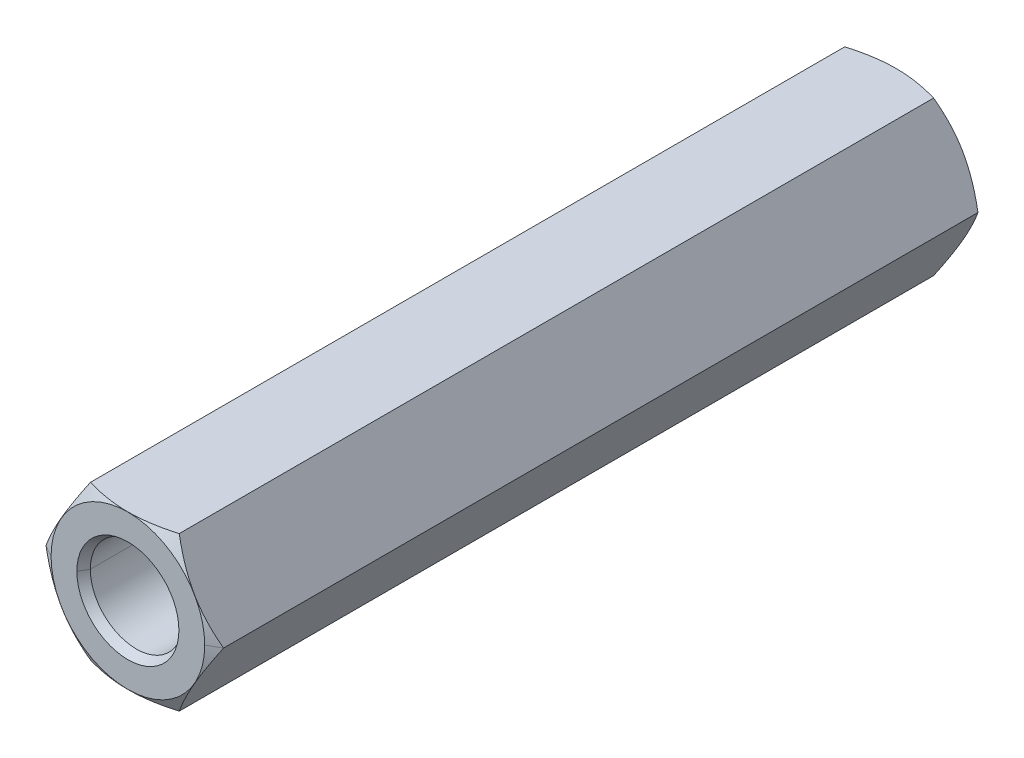
ISO-10303-21;
HEADER;
FILE_DESCRIPTION(('STEP AP214'),'2;1');
FILE_NAME('part.step','',(''),(''),'','','');
FILE_SCHEMA(('AUTOMOTIVE_DESIGN { 1 0 10303 214 1 1 1 1 }'));
ENDSEC;
DATA;
#1=APPLICATION_CONTEXT('core data for automotive mechanical design processes');
#2=APPLICATION_PROTOCOL_DEFINITION('international standard','automotive_design',2000,#1);
#3=PRODUCT_CONTEXT('',#1,'mechanical');
#4=PRODUCT('Part','Part','',(#3));
#5=PRODUCT_RELATED_PRODUCT_CATEGORY('part','',(#4));
#6=PRODUCT_DEFINITION_FORMATION('','',#4);
#7=PRODUCT_DEFINITION_CONTEXT('part definition',#1,'design');
#8=PRODUCT_DEFINITION('design','',#6,#7);
#9=PRODUCT_DEFINITION_SHAPE('','',#8);
#10=(LENGTH_UNIT() NAMED_UNIT(*) SI_UNIT(.MILLI.,.METRE.));
#11=(NAMED_UNIT(*) PLANE_ANGLE_UNIT() SI_UNIT($,.RADIAN.));
#12=(NAMED_UNIT(*) SI_UNIT($,.STERADIAN.) SOLID_ANGLE_UNIT());
#13=UNCERTAINTY_MEASURE_WITH_UNIT(LENGTH_MEASURE(1.E-05),#10,'distance_accuracy_value','');
#14=(GEOMETRIC_REPRESENTATION_CONTEXT(3) GLOBAL_UNCERTAINTY_ASSIGNED_CONTEXT((#13)) GLOBAL_UNIT_ASSIGNED_CONTEXT((#10,
#11,#12)) REPRESENTATION_CONTEXT('',''));
#15=CARTESIAN_POINT('',(0.,0.,0.));
#16=DIRECTION('',(0.,0.,1.));
#17=DIRECTION('',(1.,0.,0.));
#18=AXIS2_PLACEMENT_3D('',#15,#16,#17);
#19=CARTESIAN_POINT('',(220.318744279938,82.8420432923505,150.447608312383));
#20=DIRECTION('',(0.,0.,-1.));
#21=DIRECTION('',(1.,0.,0.));
#22=AXIS2_PLACEMENT_3D('',#19,#20,#21);
#23=CONICAL_SURFACE('',#22,1.7320508075705,1.047197551197);
#24=DIRECTION('',(0.86602540378464,0.,-0.499999999999652));
#25=VECTOR('',#24,1.);
#26=CARTESIAN_POINT('',(222.050795087508,82.8420432923505,150.447608312383));
#27=LINE('',#26,#25);
#28=CARTESIAN_POINT('',(220.318744279938,82.8420432923505,151.447608312383));
#29=VERTEX_POINT('',#28);
#30=CARTESIAN_POINT('',(221.818744279938,82.8420432923505,150.581582908599));
#31=VERTEX_POINT('',#30);
#32=EDGE_CURVE('E66',#29,#31,#27,.T.);
#33=ORIENTED_EDGE('',*,*,#32,.F.);
#34=DIRECTION('',(-0.86602540378464,0.,-0.499999999999652));
#35=VECTOR('',#34,1.);
#36=CARTESIAN_POINT('',(218.586693472367,82.8420432923505,150.447608312383));
#37=LINE('',#36,#35);
#38=CARTESIAN_POINT('',(218.818744279938,82.8420432923505,150.581582908599));
#39=VERTEX_POINT('',#38);
#40=EDGE_CURVE('E11',#29,#39,#37,.T.);
#41=ORIENTED_EDGE('',*,*,#40,.T.);
#42=CARTESIAN_POINT('',(220.318744279938,82.8420432923505,150.581582908599));
#43=DIRECTION('',(0.,0.,1.));
#44=DIRECTION('',(1.,0.,0.));
#45=AXIS2_PLACEMENT_3D('',#42,#43,#44);
#46=CIRCLE('',#45,1.5);
#47=EDGE_CURVE('E48',#31,#39,#46,.T.);
#48=ORIENTED_EDGE('',*,*,#47,.F.);
#49=EDGE_LOOP('',(#33,#41,#48));
#50=FACE_BOUND('',#49,.T.);
#51=ADVANCED_FACE('F44',(#50),#23,.F.);
#52=CARTESIAN_POINT('',(220.318744279938,82.8420432923505,150.581582908599));
#53=DIRECTION('',(0.,0.,-1.));
#54=DIRECTION('',(1.,0.,0.));
#55=AXIS2_PLACEMENT_3D('',#52,#53,#54);
#56=CYLINDRICAL_SURFACE('',#55,1.5);
#57=ORIENTED_EDGE('',*,*,#47,.T.);
#58=DIRECTION('',(0.,0.,-1.));
#59=VECTOR('',#58,1.);
#60=CARTESIAN_POINT('',(218.818744279938,82.8420432923505,150.581582908599));
#61=LINE('',#60,#59);
#62=CARTESIAN_POINT('',(218.818744279938,82.8420432923505,140.858711037809));
#63=VERTEX_POINT('',#62);
#64=EDGE_CURVE('E209',#39,#63,#61,.T.);
#65=ORIENTED_EDGE('',*,*,#64,.T.);
#66=CARTESIAN_POINT('',(220.318744279938,82.8420432923505,140.858711037809));
#67=DIRECTION('',(0.,0.,1.));
#68=DIRECTION('',(1.,0.,0.));
#69=AXIS2_PLACEMENT_3D('',#66,#67,#68);
#70=CIRCLE('',#69,1.5);
#71=CARTESIAN_POINT('',(221.818744279938,82.8420432923505,140.858711037809));
#72=VERTEX_POINT('',#71);
#73=EDGE_CURVE('E212',#72,#63,#70,.T.);
#74=ORIENTED_EDGE('',*,*,#73,.F.);
#75=DIRECTION('',(0.,0.,-1.));
#76=VECTOR('',#75,1.);
#77=CARTESIAN_POINT('',(221.818744279938,82.8420432923505,150.581582908599));
#78=LINE('',#77,#76);
#79=EDGE_CURVE('E306',#31,#72,#78,.T.);
#80=ORIENTED_EDGE('',*,*,#79,.F.);
#81=EDGE_LOOP('',(#57,#65,#74,#80));
#82=FACE_BOUND('',#81,.T.);
#83=ADVANCED_FACE('F420',(#82),#56,.F.);
#84=CARTESIAN_POINT('',(220.318744279938,82.8420432923505,140.858711037809));
#85=DIRECTION('',(0.,0.,-1.));
#86=DIRECTION('',(1.,0.,0.));
#87=AXIS2_PLACEMENT_3D('',#84,#85,#86);
#88=CONICAL_SURFACE('',#87,1.5,0.5235987756);
#89=ORIENTED_EDGE('',*,*,#73,.T.);
#90=DIRECTION('',(-0.500000000001473,0.,-0.866025403783588));
#91=VECTOR('',#90,1.);
#92=CARTESIAN_POINT('',(218.818744279938,82.8420432923505,140.858711037809));
#93=LINE('',#92,#91);
#94=CARTESIAN_POINT('',(218.658744279937,82.8420432923505,140.581582908599));
#95=VERTEX_POINT('',#94);
#96=EDGE_CURVE('E227',#63,#95,#93,.T.);
#97=ORIENTED_EDGE('',*,*,#96,.T.);
#98=CARTESIAN_POINT('',(220.318744279938,82.8420432923505,140.581582908599));
#99=DIRECTION('',(0.,0.,1.));
#100=DIRECTION('',(1.,0.,0.));
#101=AXIS2_PLACEMENT_3D('',#98,#99,#100);
#102=CIRCLE('',#101,1.66);
#103=CARTESIAN_POINT('',(221.978744279938,82.8420432923505,140.581582908599));
#104=VERTEX_POINT('',#103);
#105=EDGE_CURVE('E343',#104,#95,#102,.T.);
#106=ORIENTED_EDGE('',*,*,#105,.F.);
#107=DIRECTION('',(0.500000000001473,0.,-0.866025403783588));
#108=VECTOR('',#107,1.);
#109=CARTESIAN_POINT('',(221.818744279938,82.8420432923505,140.858711037809));
#110=LINE('',#109,#108);
#111=EDGE_CURVE('E321',#72,#104,#110,.T.);
#112=ORIENTED_EDGE('',*,*,#111,.F.);
#113=EDGE_LOOP('',(#89,#97,#106,#112));
#114=FACE_BOUND('',#113,.T.);
#115=ADVANCED_FACE('F434',(#114),#88,.F.);
#116=CARTESIAN_POINT('',(220.318744279938,82.8420432923505,140.581582908599));
#117=DIRECTION('',(0.,0.,1.));
#118=DIRECTION('',(1.,0.,0.));
#119=AXIS2_PLACEMENT_3D('',#116,#117,#118);
#120=CONICAL_SURFACE('',#119,2.5,1.047197551197);
#121=CARTESIAN_POINT('',(220.318744279938,82.8420432923505,140.581582908599));
#122=DIRECTION('',(0.,0.,1.));
#123=DIRECTION('',(1.,0.,0.));
#124=AXIS2_PLACEMENT_3D('',#121,#122,#123);
#125=CIRCLE('',#124,2.5);
#126=CARTESIAN_POINT('',(222.818744279938,82.8420432923505,140.581582908599));
#127=VERTEX_POINT('',#126);
#128=CARTESIAN_POINT('',(217.818744279938,82.8420432923505,140.581582908599));
#129=VERTEX_POINT('',#128);
#130=EDGE_CURVE('E224',#127,#129,#125,.T.);
#131=ORIENTED_EDGE('',*,*,#130,.T.);
#132=DIRECTION('',(-0.86602540378464,0.,0.499999999999652));
#133=VECTOR('',#132,1.);
#134=CARTESIAN_POINT('',(217.818744279938,82.8420432923505,140.581582908599));
#135=LINE('',#134,#133);
#136=CARTESIAN_POINT('',(217.428744279937,82.8420432923504,140.806749513583));
#137=VERTEX_POINT('',#136);
#138=EDGE_CURVE('E228',#129,#137,#135,.T.);
#139=ORIENTED_EDGE('',*,*,#138,.T.);
#140=CARTESIAN_POINT('',(218.873744279938,85.3448567092875,140.806749513583));
#141=CARTESIAN_POINT('',(218.151244279938,84.0934500008193,140.389613944093));
#142=CARTESIAN_POINT('',(217.428744279937,82.8420432923504,140.806749513583));
#143=(BOUNDED_CURVE() B_SPLINE_CURVE(2,(#140,#141,#142),.UNSPECIFIED.,.F.,
.F.) B_SPLINE_CURVE_WITH_KNOTS((3,3),(0.,1.),
.UNSPECIFIED.) CURVE() GEOMETRIC_REPRESENTATION_ITEM() RATIONAL_B_SPLINE_CURVE((1.,
1.15470053837935,1.)) REPRESENTATION_ITEM(''));
#144=CARTESIAN_POINT('',(218.873744279938,85.3448567092875,140.806749513583));
#145=VERTEX_POINT('',#144);
#146=EDGE_CURVE('E249',#145,#137,#143,.T.);
#147=ORIENTED_EDGE('',*,*,#146,.F.);
#148=CARTESIAN_POINT('',(221.763744279937,85.3448567092875,140.806749513583));
#149=CARTESIAN_POINT('',(220.318744279938,85.3448567092874,140.389613944093));
#150=CARTESIAN_POINT('',(218.873744279938,85.3448567092875,140.806749513583));
#151=(BOUNDED_CURVE() B_SPLINE_CURVE(2,(#148,#149,#150),.UNSPECIFIED.,.F.,
.F.) B_SPLINE_CURVE_WITH_KNOTS((3,3),(0.,1.),
.UNSPECIFIED.) CURVE() GEOMETRIC_REPRESENTATION_ITEM() RATIONAL_B_SPLINE_CURVE((1.,
1.15470053837926,1.)) REPRESENTATION_ITEM(''));
#152=CARTESIAN_POINT('',(221.763744279937,85.3448567092875,140.806749513583));
#153=VERTEX_POINT('',#152);
#154=EDGE_CURVE('E358',#153,#145,#151,.T.);
#155=ORIENTED_EDGE('',*,*,#154,.F.);
#156=CARTESIAN_POINT('',(223.208744279937,82.8420432923505,140.806749513583));
#157=CARTESIAN_POINT('',(222.486244279938,84.0934500008188,140.389613944093));
#158=CARTESIAN_POINT('',(221.763744279937,85.3448567092875,140.806749513583));
#159=(BOUNDED_CURVE() B_SPLINE_CURVE(2,(#156,#157,#158),.UNSPECIFIED.,.F.,
.F.) B_SPLINE_CURVE_WITH_KNOTS((3,3),(0.,1.),
.UNSPECIFIED.) CURVE() GEOMETRIC_REPRESENTATION_ITEM() RATIONAL_B_SPLINE_CURVE((1.,
1.15470053837946,1.)) REPRESENTATION_ITEM(''));
#160=CARTESIAN_POINT('',(223.208744279937,82.8420432923505,140.806749513583));
#161=VERTEX_POINT('',#160);
#162=EDGE_CURVE('E260',#161,#153,#159,.T.);
#163=ORIENTED_EDGE('',*,*,#162,.F.);
#164=DIRECTION('',(0.86602540378464,0.,0.499999999999652));
#165=VECTOR('',#164,1.);
#166=CARTESIAN_POINT('',(222.818744279938,82.8420432923505,140.581582908599));
#167=LINE('',#166,#165);
#168=EDGE_CURVE('E261',#127,#161,#167,.T.);
#169=ORIENTED_EDGE('',*,*,#168,.F.);
#170=EDGE_LOOP('',(#131,#139,#147,#155,#163,#169));
#171=FACE_BOUND('',#170,.T.);
#172=ADVANCED_FACE('F441',(#171),#120,.T.);
#173=CARTESIAN_POINT('',(220.318744279938,82.8420432923505,165.356416303615));
#174=DIRECTION('',(0.,0.,-1.));
#175=DIRECTION('',(1.,0.,0.));
#176=AXIS2_PLACEMENT_3D('',#173,#174,#175);
#177=CONICAL_SURFACE('',#176,2.89,1.047197551197);
#178=CARTESIAN_POINT('',(220.318744279938,82.8420432923505,165.581582908599));
#179=DIRECTION('',(0.,0.,1.));
#180=DIRECTION('',(1.,0.,0.));
#181=AXIS2_PLACEMENT_3D('',#178,#179,#180);
#182=CIRCLE('',#181,2.5);
#183=CARTESIAN_POINT('',(217.818744279938,82.8420432923505,165.581582908599));
#184=VERTEX_POINT('',#183);
#185=CARTESIAN_POINT('',(222.818744279938,82.8420432923505,165.581582908599));
#186=VERTEX_POINT('',#185);
#187=EDGE_CURVE('E218',#184,#186,#182,.T.);
#188=ORIENTED_EDGE('',*,*,#187,.F.);
#189=DIRECTION('',(-0.86602540378464,0.,-0.499999999999652));
#190=VECTOR('',#189,1.);
#191=CARTESIAN_POINT('',(217.428744279937,82.8420432923505,165.356416303615));
#192=LINE('',#191,#190);
#193=CARTESIAN_POINT('',(217.428744279937,82.8420432923505,165.356416303615));
#194=VERTEX_POINT('',#193);
#195=EDGE_CURVE('E178',#184,#194,#192,.T.);
#196=ORIENTED_EDGE('',*,*,#195,.T.);
#197=CARTESIAN_POINT('',(218.873744279938,80.3392298754135,165.356416303615));
#198=CARTESIAN_POINT('',(218.151244279937,81.5906365838815,165.773551873104));
#199=CARTESIAN_POINT('',(217.428744279937,82.8420432923505,165.356416303615));
#200=(BOUNDED_CURVE() B_SPLINE_CURVE(2,(#197,#198,#199),.UNSPECIFIED.,.F.,
.F.) B_SPLINE_CURVE_WITH_KNOTS((3,3),(0.,1.),
.UNSPECIFIED.) CURVE() GEOMETRIC_REPRESENTATION_ITEM() RATIONAL_B_SPLINE_CURVE((1.,
1.15470053837936,1.)) REPRESENTATION_ITEM(''));
#201=CARTESIAN_POINT('',(218.873744279938,80.3392298754135,165.356416303615));
#202=VERTEX_POINT('',#201);
#203=EDGE_CURVE('E171',#202,#194,#200,.T.);
#204=ORIENTED_EDGE('',*,*,#203,.F.);
#205=CARTESIAN_POINT('',(221.763744279937,80.3392298754135,165.356416303615));
#206=CARTESIAN_POINT('',(220.318744279938,80.3392298754134,165.773551873104));
#207=CARTESIAN_POINT('',(218.873744279938,80.3392298754135,165.356416303615));
#208=(BOUNDED_CURVE() B_SPLINE_CURVE(2,(#205,#206,#207),.UNSPECIFIED.,.F.,
.F.) B_SPLINE_CURVE_WITH_KNOTS((3,3),(0.,1.),
.UNSPECIFIED.) CURVE() GEOMETRIC_REPRESENTATION_ITEM() RATIONAL_B_SPLINE_CURVE((1.,
1.15470053837925,1.)) REPRESENTATION_ITEM(''));
#209=CARTESIAN_POINT('',(221.763744279937,80.3392298754135,165.356416303615));
#210=VERTEX_POINT('',#209);
#211=EDGE_CURVE('E175',#210,#202,#208,.T.);
#212=ORIENTED_EDGE('',*,*,#211,.F.);
#213=CARTESIAN_POINT('',(223.208744279937,82.8420432923505,165.356416303615));
#214=CARTESIAN_POINT('',(222.486244279938,81.5906365838821,165.773551873105));
#215=CARTESIAN_POINT('',(221.763744279937,80.3392298754135,165.356416303615));
#216=(BOUNDED_CURVE() B_SPLINE_CURVE(2,(#213,#214,#215),.UNSPECIFIED.,.F.,
.F.) B_SPLINE_CURVE_WITH_KNOTS((3,3),(0.,1.),
.UNSPECIFIED.) CURVE() GEOMETRIC_REPRESENTATION_ITEM() RATIONAL_B_SPLINE_CURVE((1.,
1.15470053837944,1.)) REPRESENTATION_ITEM(''));
#217=CARTESIAN_POINT('',(223.208744279937,82.8420432923505,165.356416303615));
#218=VERTEX_POINT('',#217);
#219=EDGE_CURVE('E278',#218,#210,#216,.T.);
#220=ORIENTED_EDGE('',*,*,#219,.F.);
#221=DIRECTION('',(0.86602540378464,0.,-0.499999999999652));
#222=VECTOR('',#221,1.);
#223=CARTESIAN_POINT('',(223.208744279937,82.8420432923505,165.356416303615));
#224=LINE('',#223,#222);
#225=EDGE_CURVE('E277',#186,#218,#224,.T.);
#226=ORIENTED_EDGE('',*,*,#225,.F.);
#227=EDGE_LOOP('',(#188,#196,#204,#212,#220,#226));
#228=FACE_BOUND('',#227,.T.);
#229=ADVANCED_FACE('F173',(#228),#177,.T.);
#230=CARTESIAN_POINT('',(220.318744279938,82.8420432923505,165.581582908599));
#231=DIRECTION('',(0.,0.,1.));
#232=DIRECTION('',(1.,0.,0.));
#233=AXIS2_PLACEMENT_3D('',#230,#231,#232);
#234=CONICAL_SURFACE('',#233,1.65999999999899,0.523598775598);
#235=CARTESIAN_POINT('',(220.318744279938,82.8420432923505,165.304454779388));
#236=DIRECTION('',(0.,0.,1.));
#237=DIRECTION('',(1.,0.,0.));
#238=AXIS2_PLACEMENT_3D('',#235,#236,#237);
#239=CIRCLE('',#238,1.5);
#240=CARTESIAN_POINT('',(218.818744279938,82.8420432923505,165.304454779388));
#241=VERTEX_POINT('',#240);
#242=CARTESIAN_POINT('',(221.818744279938,82.8420432923505,165.304454779388));
#243=VERTEX_POINT('',#242);
#244=EDGE_CURVE('E354',#241,#243,#239,.T.);
#245=ORIENTED_EDGE('',*,*,#244,.F.);
#246=DIRECTION('',(-0.499999999999741,0.,0.866025403784588));
#247=VECTOR('',#246,1.);
#248=CARTESIAN_POINT('',(218.658744279938,82.8420432923505,165.581582908599));
#249=LINE('',#248,#247);
#250=CARTESIAN_POINT('',(218.658744279938,82.8420432923505,165.581582908599));
#251=VERTEX_POINT('',#250);
#252=EDGE_CURVE('E245',#241,#251,#249,.T.);
#253=ORIENTED_EDGE('',*,*,#252,.T.);
#254=CARTESIAN_POINT('',(220.318744279938,82.8420432923505,165.581582908599));
#255=DIRECTION('',(0.,0.,1.));
#256=DIRECTION('',(1.,0.,0.));
#257=AXIS2_PLACEMENT_3D('',#254,#255,#256);
#258=CIRCLE('',#257,1.65999999999899);
#259=CARTESIAN_POINT('',(221.978744279937,82.8420432923505,165.581582908599));
#260=VERTEX_POINT('',#259);
#261=EDGE_CURVE('E266',#251,#260,#258,.T.);
#262=ORIENTED_EDGE('',*,*,#261,.T.);
#263=DIRECTION('',(0.499999999999741,0.,0.866025403784588));
#264=VECTOR('',#263,1.);
#265=CARTESIAN_POINT('',(221.978744279937,82.8420432923505,165.581582908599));
#266=LINE('',#265,#264);
#267=EDGE_CURVE('E325',#243,#260,#266,.T.);
#268=ORIENTED_EDGE('',*,*,#267,.F.);
#269=EDGE_LOOP('',(#245,#253,#262,#268));
#270=FACE_BOUND('',#269,.T.);
#271=ADVANCED_FACE('F443',(#270),#234,.F.);
#272=CARTESIAN_POINT('',(220.318744279938,82.8420432923505,165.304454779388));
#273=DIRECTION('',(0.,0.,-1.));
#274=DIRECTION('',(1.,0.,0.));
#275=AXIS2_PLACEMENT_3D('',#272,#273,#274);
#276=CYLINDRICAL_SURFACE('',#275,1.5);
#277=CARTESIAN_POINT('',(220.318744279938,82.8420432923505,165.304454779388));
#278=DIRECTION('',(0.,0.,1.));
#279=DIRECTION('',(1.,0.,0.));
#280=AXIS2_PLACEMENT_3D('',#277,#278,#279);
#281=CIRCLE('',#280,1.5);
#282=EDGE_CURVE('E270',#243,#241,#281,.T.);
#283=ORIENTED_EDGE('',*,*,#282,.T.);
#284=DIRECTION('',(0.,0.,-1.));
#285=VECTOR('',#284,1.);
#286=CARTESIAN_POINT('',(218.818744279938,82.8420432923505,165.304454779388));
#287=LINE('',#286,#285);
#288=CARTESIAN_POINT('',(218.818744279938,82.8420432923505,155.581582908599));
#289=VERTEX_POINT('',#288);
#290=EDGE_CURVE('E347',#241,#289,#287,.T.);
#291=ORIENTED_EDGE('',*,*,#290,.T.);
#292=CARTESIAN_POINT('',(220.318744279938,82.8420432923505,155.581582908599));
#293=DIRECTION('',(0.,0.,1.));
#294=DIRECTION('',(1.,0.,0.));
#295=AXIS2_PLACEMENT_3D('',#292,#293,#294);
#296=CIRCLE('',#295,1.5);
#297=CARTESIAN_POINT('',(221.818744279938,82.8420432923505,155.581582908599));
#298=VERTEX_POINT('',#297);
#299=EDGE_CURVE('E223',#298,#289,#296,.T.);
#300=ORIENTED_EDGE('',*,*,#299,.F.);
#301=DIRECTION('',(0.,0.,-1.));
#302=VECTOR('',#301,1.);
#303=CARTESIAN_POINT('',(221.818744279938,82.8420432923505,165.304454779388));
#304=LINE('',#303,#302);
#305=EDGE_CURVE('E328',#243,#298,#304,.T.);
#306=ORIENTED_EDGE('',*,*,#305,.F.);
#307=EDGE_LOOP('',(#283,#291,#300,#306));
#308=FACE_BOUND('',#307,.T.);
#309=ADVANCED_FACE('F446',(#308),#276,.F.);
#310=CARTESIAN_POINT('',(220.318744279938,82.8420432923505,155.581582908599));
#311=DIRECTION('',(0.,0.,1.));
#312=DIRECTION('',(1.,0.,0.));
#313=AXIS2_PLACEMENT_3D('',#310,#311,#312);
#314=CONICAL_SURFACE('',#313,1.5,1.047197551197);
#315=DIRECTION('',(0.86602540378464,0.,0.499999999999652));
#316=VECTOR('',#315,1.);
#317=CARTESIAN_POINT('',(221.818744279938,82.8420432923505,155.581582908599));
#318=LINE('',#317,#316);
#319=CARTESIAN_POINT('',(220.318744279938,82.8420432923505,154.715557504813));
#320=VERTEX_POINT('',#319);
#321=EDGE_CURVE('E219',#320,#298,#318,.T.);
#322=ORIENTED_EDGE('',*,*,#321,.F.);
#323=DIRECTION('',(-0.86602540378464,0.,0.499999999999652));
#324=VECTOR('',#323,1.);
#325=CARTESIAN_POINT('',(218.818744279938,82.8420432923505,155.581582908599));
#326=LINE('',#325,#324);
#327=EDGE_CURVE('E255',#320,#289,#326,.T.);
#328=ORIENTED_EDGE('',*,*,#327,.T.);
#329=CARTESIAN_POINT('',(220.318744279938,82.8420432923505,155.581582908599));
#330=DIRECTION('',(0.,0.,1.));
#331=DIRECTION('',(1.,0.,0.));
#332=AXIS2_PLACEMENT_3D('',#329,#330,#331);
#333=CIRCLE('',#332,1.5);
#334=EDGE_CURVE('E222',#289,#298,#333,.T.);
#335=ORIENTED_EDGE('',*,*,#334,.T.);
#336=EDGE_LOOP('',(#322,#328,#335));
#337=FACE_BOUND('',#336,.T.);
#338=ADVANCED_FACE('F458',(#337),#314,.F.);
#339=CARTESIAN_POINT('',(220.318744279938,82.8420432923505,155.581582908599));
#340=DIRECTION('',(0.,0.,1.));
#341=DIRECTION('',(1.,0.,0.));
#342=AXIS2_PLACEMENT_3D('',#339,#340,#341);
#343=CONICAL_SURFACE('',#342,1.5,1.047197551197);
#344=ORIENTED_EDGE('',*,*,#327,.F.);
#345=ORIENTED_EDGE('',*,*,#321,.T.);
#346=ORIENTED_EDGE('',*,*,#299,.T.);
#347=EDGE_LOOP('',(#344,#345,#346));
#348=FACE_BOUND('',#347,.T.);
#349=ADVANCED_FACE('F564',(#348),#343,.F.);
#350=CARTESIAN_POINT('',(220.318744279938,82.8420432923505,165.304454779388));
#351=DIRECTION('',(0.,0.,-1.));
#352=DIRECTION('',(1.,0.,0.));
#353=AXIS2_PLACEMENT_3D('',#350,#351,#352);
#354=CYLINDRICAL_SURFACE('',#353,1.5);
#355=ORIENTED_EDGE('',*,*,#290,.F.);
#356=ORIENTED_EDGE('',*,*,#244,.T.);
#357=ORIENTED_EDGE('',*,*,#305,.T.);
#358=ORIENTED_EDGE('',*,*,#334,.F.);
#359=EDGE_LOOP('',(#355,#356,#357,#358));
#360=FACE_BOUND('',#359,.T.);
#361=ADVANCED_FACE('F584',(#360),#354,.F.);
#362=CARTESIAN_POINT('',(220.318744279938,82.8420432923505,165.581582908599));
#363=DIRECTION('',(0.,0.,1.));
#364=DIRECTION('',(1.,0.,0.));
#365=AXIS2_PLACEMENT_3D('',#362,#363,#364);
#366=CONICAL_SURFACE('',#365,1.65999999999899,0.523598775598);
#367=ORIENTED_EDGE('',*,*,#252,.F.);
#368=ORIENTED_EDGE('',*,*,#282,.F.);
#369=ORIENTED_EDGE('',*,*,#267,.T.);
#370=CARTESIAN_POINT('',(220.318744279938,82.8420432923505,165.581582908599));
#371=DIRECTION('',(0.,0.,1.));
#372=DIRECTION('',(1.,0.,0.));
#373=AXIS2_PLACEMENT_3D('',#370,#371,#372);
#374=CIRCLE('',#373,1.65999999999899);
#375=EDGE_CURVE('E217',#260,#251,#374,.T.);
#376=ORIENTED_EDGE('',*,*,#375,.T.);
#377=EDGE_LOOP('',(#367,#368,#369,#376));
#378=FACE_BOUND('',#377,.T.);
#379=ADVANCED_FACE('F513',(#378),#366,.F.);
#380=CARTESIAN_POINT('',(220.318744279938,82.8420432923505,165.581582908599));
#381=DIRECTION('',(0.,0.,1.));
#382=DIRECTION('',(1.,0.,0.));
#383=AXIS2_PLACEMENT_3D('',#380,#381,#382);
#384=PLANE('',#383);
#385=CARTESIAN_POINT('',(220.318744279938,82.8420432923505,165.581582908599));
#386=DIRECTION('',(0.,0.,1.));
#387=DIRECTION('',(1.,0.,0.));
#388=AXIS2_PLACEMENT_3D('',#385,#386,#387);
#389=CIRCLE('',#388,2.5);
#390=EDGE_CURVE('E213',#186,#184,#389,.T.);
#391=ORIENTED_EDGE('',*,*,#390,.T.);
#392=ORIENTED_EDGE('',*,*,#187,.T.);
#393=EDGE_LOOP('',(#391,#392));
#394=FACE_BOUND('',#393,.T.);
#395=ORIENTED_EDGE('',*,*,#375,.F.);
#396=ORIENTED_EDGE('',*,*,#261,.F.);
#397=EDGE_LOOP('',(#395,#396));
#398=FACE_BOUND('',#397,.T.);
#399=ADVANCED_FACE('F468',(#394,#398),#384,.T.);
#400=CARTESIAN_POINT('',(220.318744279938,82.8420432923505,165.356416303615));
#401=DIRECTION('',(0.,0.,-1.));
#402=DIRECTION('',(1.,0.,0.));
#403=AXIS2_PLACEMENT_3D('',#400,#401,#402);
#404=CONICAL_SURFACE('',#403,2.89,1.047197551197);
#405=ORIENTED_EDGE('',*,*,#195,.F.);
#406=ORIENTED_EDGE('',*,*,#390,.F.);
#407=ORIENTED_EDGE('',*,*,#225,.T.);
#408=CARTESIAN_POINT('',(221.763744279937,85.3448567092875,165.356416303615));
#409=CARTESIAN_POINT('',(222.486244279938,84.0934500008193,165.773551873104));
#410=CARTESIAN_POINT('',(223.208744279937,82.8420432923505,165.356416303615));
#411=(BOUNDED_CURVE() B_SPLINE_CURVE(2,(#408,#409,#410),.UNSPECIFIED.,.F.,
.F.) B_SPLINE_CURVE_WITH_KNOTS((3,3),(0.,1.),
.UNSPECIFIED.) CURVE() GEOMETRIC_REPRESENTATION_ITEM() RATIONAL_B_SPLINE_CURVE((1.,
1.15470053837935,1.)) REPRESENTATION_ITEM(''));
#412=CARTESIAN_POINT('',(221.763744279937,85.3448567092875,165.356416303615));
#413=VERTEX_POINT('',#412);
#414=EDGE_CURVE('E293',#413,#218,#411,.T.);
#415=ORIENTED_EDGE('',*,*,#414,.F.);
#416=CARTESIAN_POINT('',(218.873744279938,85.3448567092875,165.356416303615));
#417=CARTESIAN_POINT('',(220.318744279937,85.3448567092874,165.773551873104));
#418=CARTESIAN_POINT('',(221.763744279937,85.3448567092875,165.356416303615));
#419=(BOUNDED_CURVE() B_SPLINE_CURVE(2,(#416,#417,#418),.UNSPECIFIED.,.F.,
.F.) B_SPLINE_CURVE_WITH_KNOTS((3,3),(0.,1.),
.UNSPECIFIED.) CURVE() GEOMETRIC_REPRESENTATION_ITEM() RATIONAL_B_SPLINE_CURVE((1.,
1.15470053837925,1.)) REPRESENTATION_ITEM(''));
#420=CARTESIAN_POINT('',(218.873744279938,85.3448567092875,165.356416303615));
#421=VERTEX_POINT('',#420);
#422=EDGE_CURVE('E365',#421,#413,#419,.T.);
#423=ORIENTED_EDGE('',*,*,#422,.F.);
#424=CARTESIAN_POINT('',(217.428744279937,82.8420432923505,165.356416303615));
#425=CARTESIAN_POINT('',(218.151244279937,84.0934500008188,165.773551873104));
#426=CARTESIAN_POINT('',(218.873744279938,85.3448567092875,165.356416303615));
#427=(BOUNDED_CURVE() B_SPLINE_CURVE(2,(#424,#425,#426),.UNSPECIFIED.,.F.,
.F.) B_SPLINE_CURVE_WITH_KNOTS((3,3),(0.,1.),
.UNSPECIFIED.) CURVE() GEOMETRIC_REPRESENTATION_ITEM() RATIONAL_B_SPLINE_CURVE((1.,
1.15470053837944,1.)) REPRESENTATION_ITEM(''));
#428=EDGE_CURVE('E265',#194,#421,#427,.T.);
#429=ORIENTED_EDGE('',*,*,#428,.F.);
#430=EDGE_LOOP('',(#405,#406,#407,#415,#423,#429));
#431=FACE_BOUND('',#430,.T.);
#432=ADVANCED_FACE('F462',(#431),#404,.T.);
#433=CARTESIAN_POINT('',(221.763744279937,80.3392298754135,140.581582908599));
#434=DIRECTION('',(-0.866025403784329,0.50000000000019,0.));
#435=DIRECTION('',(0.,0.,1.));
#436=AXIS2_PLACEMENT_3D('',#433,#434,#435);
#437=PLANE('',#436);
#438=DIRECTION('',(0.,0.,1.));
#439=VECTOR('',#438,1.);
#440=CARTESIAN_POINT('',(223.208744279937,82.8420432923505,140.806749513583));
#441=LINE('',#440,#439);
#442=EDGE_CURVE('E283',#161,#218,#441,.T.);
#443=ORIENTED_EDGE('',*,*,#442,.T.);
#444=ORIENTED_EDGE('',*,*,#219,.T.);
#445=DIRECTION('',(0.,0.,1.));
#446=VECTOR('',#445,1.);
#447=CARTESIAN_POINT('',(221.763744279937,80.3392298754135,140.581582908599));
#448=LINE('',#447,#446);
#449=CARTESIAN_POINT('',(221.763744279937,80.3392298754135,140.806749513583));
#450=VERTEX_POINT('',#449);
#451=EDGE_CURVE('E191',#450,#210,#448,.T.);
#452=ORIENTED_EDGE('',*,*,#451,.F.);
#453=CARTESIAN_POINT('',(221.763744279937,80.3392298754135,140.806749513583));
#454=CARTESIAN_POINT('',(222.486244279938,81.5906365838816,140.389613944093));
#455=CARTESIAN_POINT('',(223.208744279937,82.8420432923505,140.806749513583));
#456=(BOUNDED_CURVE() B_SPLINE_CURVE(2,(#453,#454,#455),.UNSPECIFIED.,.F.,
.F.) B_SPLINE_CURVE_WITH_KNOTS((3,3),(0.,1.),
.UNSPECIFIED.) CURVE() GEOMETRIC_REPRESENTATION_ITEM() RATIONAL_B_SPLINE_CURVE((1.,
1.15470053837935,1.)) REPRESENTATION_ITEM(''));
#457=EDGE_CURVE('E284',#450,#161,#456,.T.);
#458=ORIENTED_EDGE('',*,*,#457,.T.);
#459=EDGE_LOOP('',(#443,#444,#452,#458));
#460=FACE_BOUND('',#459,.T.);
#461=ADVANCED_FACE('F460',(#460),#437,.F.);
#462=CARTESIAN_POINT('',(218.873744279938,80.3392298754135,140.581582908599));
#463=DIRECTION('',(0.,1.,0.));
#464=DIRECTION('',(1.,0.,0.));
#465=AXIS2_PLACEMENT_3D('',#462,#463,#464);
#466=PLANE('',#465);
#467=ORIENTED_EDGE('',*,*,#451,.T.);
#468=ORIENTED_EDGE('',*,*,#211,.T.);
#469=DIRECTION('',(0.,0.,1.));
#470=VECTOR('',#469,1.);
#471=CARTESIAN_POINT('',(218.873744279938,80.3392298754135,140.581582908599));
#472=LINE('',#471,#470);
#473=CARTESIAN_POINT('',(218.873744279938,80.3392298754135,140.806749513583));
#474=VERTEX_POINT('',#473);
#475=EDGE_CURVE('E184',#474,#202,#472,.T.);
#476=ORIENTED_EDGE('',*,*,#475,.F.);
#477=CARTESIAN_POINT('',(218.873744279938,80.3392298754135,140.806749513583));
#478=CARTESIAN_POINT('',(220.318744279938,80.3392298754134,140.389613944093));
#479=CARTESIAN_POINT('',(221.763744279937,80.3392298754135,140.806749513583));
#480=(BOUNDED_CURVE() B_SPLINE_CURVE(2,(#477,#478,#479),.UNSPECIFIED.,.F.,
.F.) B_SPLINE_CURVE_WITH_KNOTS((3,3),(0.,1.),
.UNSPECIFIED.) CURVE() GEOMETRIC_REPRESENTATION_ITEM() RATIONAL_B_SPLINE_CURVE((1.,
1.15470053837926,1.)) REPRESENTATION_ITEM(''));
#481=EDGE_CURVE('E193',#474,#450,#480,.T.);
#482=ORIENTED_EDGE('',*,*,#481,.T.);
#483=EDGE_LOOP('',(#467,#468,#476,#482));
#484=FACE_BOUND('',#483,.T.);
#485=ADVANCED_FACE('F46',(#484),#466,.F.);
#486=CARTESIAN_POINT('',(217.428744279937,82.8420432923505,140.581582908599));
#487=DIRECTION('',(0.866025403784329,0.50000000000019,0.));
#488=DIRECTION('',(0.,0.,-1.));
#489=AXIS2_PLACEMENT_3D('',#486,#487,#488);
#490=PLANE('',#489);
#491=ORIENTED_EDGE('',*,*,#475,.T.);
#492=ORIENTED_EDGE('',*,*,#203,.T.);
#493=DIRECTION('',(0.,0.,1.));
#494=VECTOR('',#493,1.);
#495=CARTESIAN_POINT('',(217.428744279937,82.8420432923505,140.581582908599));
#496=LINE('',#495,#494);
#497=EDGE_CURVE('E262',#137,#194,#496,.T.);
#498=ORIENTED_EDGE('',*,*,#497,.F.);
#499=CARTESIAN_POINT('',(217.428744279937,82.8420432923504,140.806749513583));
#500=CARTESIAN_POINT('',(218.151244279937,81.590636583882,140.389613944093));
#501=CARTESIAN_POINT('',(218.873744279938,80.3392298754135,140.806749513583));
#502=(BOUNDED_CURVE() B_SPLINE_CURVE(2,(#499,#500,#501),.UNSPECIFIED.,.F.,
.F.) B_SPLINE_CURVE_WITH_KNOTS((3,3),(0.,1.),
.UNSPECIFIED.) CURVE() GEOMETRIC_REPRESENTATION_ITEM() RATIONAL_B_SPLINE_CURVE((1.,
1.15470053837945,1.)) REPRESENTATION_ITEM(''));
#503=EDGE_CURVE('E185',#137,#474,#502,.T.);
#504=ORIENTED_EDGE('',*,*,#503,.T.);
#505=EDGE_LOOP('',(#491,#492,#498,#504));
#506=FACE_BOUND('',#505,.T.);
#507=ADVANCED_FACE('F196',(#506),#490,.F.);
#508=CARTESIAN_POINT('',(218.873744279938,85.3448567092875,140.581582908599));
#509=DIRECTION('',(0.866025403784329,-0.50000000000019,0.));
#510=DIRECTION('',(0.,0.,-1.));
#511=AXIS2_PLACEMENT_3D('',#508,#509,#510);
#512=PLANE('',#511);
#513=ORIENTED_EDGE('',*,*,#497,.T.);
#514=ORIENTED_EDGE('',*,*,#428,.T.);
#515=DIRECTION('',(0.,0.,1.));
#516=VECTOR('',#515,1.);
#517=CARTESIAN_POINT('',(218.873744279938,85.3448567092875,140.581582908599));
#518=LINE('',#517,#516);
#519=EDGE_CURVE('E361',#145,#421,#518,.T.);
#520=ORIENTED_EDGE('',*,*,#519,.F.);
#521=ORIENTED_EDGE('',*,*,#146,.T.);
#522=EDGE_LOOP('',(#513,#514,#520,#521));
#523=FACE_BOUND('',#522,.T.);
#524=ADVANCED_FACE('F508',(#523),#512,.F.);
#525=CARTESIAN_POINT('',(221.763744279937,85.3448567092875,140.581582908599));
#526=DIRECTION('',(0.,-1.,0.));
#527=DIRECTION('',(-1.,0.,0.));
#528=AXIS2_PLACEMENT_3D('',#525,#526,#527);
#529=PLANE('',#528);
#530=ORIENTED_EDGE('',*,*,#519,.T.);
#531=ORIENTED_EDGE('',*,*,#422,.T.);
#532=DIRECTION('',(0.,0.,1.));
#533=VECTOR('',#532,1.);
#534=CARTESIAN_POINT('',(221.763744279937,85.3448567092875,140.581582908599));
#535=LINE('',#534,#533);
#536=EDGE_CURVE('E301',#153,#413,#535,.T.);
#537=ORIENTED_EDGE('',*,*,#536,.F.);
#538=ORIENTED_EDGE('',*,*,#154,.T.);
#539=EDGE_LOOP('',(#530,#531,#537,#538));
#540=FACE_BOUND('',#539,.T.);
#541=ADVANCED_FACE('F453',(#540),#529,.F.);
#542=CARTESIAN_POINT('',(223.208744279937,82.8420432923505,140.581582908599));
#543=DIRECTION('',(-0.866025403784329,-0.50000000000019,0.));
#544=DIRECTION('',(-0.50000000000019,0.866025403784329,0.));
#545=AXIS2_PLACEMENT_3D('',#542,#543,#544);
#546=PLANE('',#545);
#547=ORIENTED_EDGE('',*,*,#536,.T.);
#548=ORIENTED_EDGE('',*,*,#414,.T.);
#549=ORIENTED_EDGE('',*,*,#442,.F.);
#550=ORIENTED_EDGE('',*,*,#162,.T.);
#551=EDGE_LOOP('',(#547,#548,#549,#550));
#552=FACE_BOUND('',#551,.T.);
#553=ADVANCED_FACE('F450',(#552),#546,.F.);
#554=CARTESIAN_POINT('',(220.318744279938,82.8420432923505,140.581582908599));
#555=DIRECTION('',(0.,0.,1.));
#556=DIRECTION('',(1.,0.,0.));
#557=AXIS2_PLACEMENT_3D('',#554,#555,#556);
#558=CONICAL_SURFACE('',#557,2.5,1.047197551197);
#559=ORIENTED_EDGE('',*,*,#138,.F.);
#560=CARTESIAN_POINT('',(220.318744279938,82.8420432923505,140.581582908599));
#561=DIRECTION('',(0.,0.,1.));
#562=DIRECTION('',(1.,0.,0.));
#563=AXIS2_PLACEMENT_3D('',#560,#561,#562);
#564=CIRCLE('',#563,2.5);
#565=EDGE_CURVE('E256',#129,#127,#564,.T.);
#566=ORIENTED_EDGE('',*,*,#565,.T.);
#567=ORIENTED_EDGE('',*,*,#168,.T.);
#568=ORIENTED_EDGE('',*,*,#457,.F.);
#569=ORIENTED_EDGE('',*,*,#481,.F.);
#570=ORIENTED_EDGE('',*,*,#503,.F.);
#571=EDGE_LOOP('',(#559,#566,#567,#568,#569,#570));
#572=FACE_BOUND('',#571,.T.);
#573=ADVANCED_FACE('F452',(#572),#558,.T.);
#574=CARTESIAN_POINT('',(220.318744279938,82.8420432923505,140.581582908599));
#575=DIRECTION('',(0.,0.,1.));
#576=DIRECTION('',(1.,0.,0.));
#577=AXIS2_PLACEMENT_3D('',#574,#575,#576);
#578=PLANE('',#577);
#579=ORIENTED_EDGE('',*,*,#130,.F.);
#580=ORIENTED_EDGE('',*,*,#565,.F.);
#581=EDGE_LOOP('',(#579,#580));
#582=FACE_BOUND('',#581,.T.);
#583=ORIENTED_EDGE('',*,*,#105,.T.);
#584=CARTESIAN_POINT('',(220.318744279938,82.8420432923505,140.581582908599));
#585=DIRECTION('',(0.,0.,1.));
#586=DIRECTION('',(1.,0.,0.));
#587=AXIS2_PLACEMENT_3D('',#584,#585,#586);
#588=CIRCLE('',#587,1.66);
#589=EDGE_CURVE('E345',#95,#104,#588,.T.);
#590=ORIENTED_EDGE('',*,*,#589,.T.);
#591=EDGE_LOOP('',(#583,#590));
#592=FACE_BOUND('',#591,.T.);
#593=ADVANCED_FACE('F576',(#582,#592),#578,.F.);
#594=CARTESIAN_POINT('',(220.318744279938,82.8420432923505,140.858711037809));
#595=DIRECTION('',(0.,0.,-1.));
#596=DIRECTION('',(1.,0.,0.));
#597=AXIS2_PLACEMENT_3D('',#594,#595,#596);
#598=CONICAL_SURFACE('',#597,1.5,0.5235987756);
#599=ORIENTED_EDGE('',*,*,#96,.F.);
#600=CARTESIAN_POINT('',(220.318744279938,82.8420432923505,140.858711037809));
#601=DIRECTION('',(0.,0.,1.));
#602=DIRECTION('',(1.,0.,0.));
#603=AXIS2_PLACEMENT_3D('',#600,#601,#602);
#604=CIRCLE('',#603,1.5);
#605=EDGE_CURVE('E324',#63,#72,#604,.T.);
#606=ORIENTED_EDGE('',*,*,#605,.T.);
#607=ORIENTED_EDGE('',*,*,#111,.T.);
#608=ORIENTED_EDGE('',*,*,#589,.F.);
#609=EDGE_LOOP('',(#599,#606,#607,#608));
#610=FACE_BOUND('',#609,.T.);
#611=ADVANCED_FACE('F413',(#610),#598,.F.);
#612=CARTESIAN_POINT('',(220.318744279938,82.8420432923505,150.581582908599));
#613=DIRECTION('',(0.,0.,-1.));
#614=DIRECTION('',(1.,0.,0.));
#615=AXIS2_PLACEMENT_3D('',#612,#613,#614);
#616=CYLINDRICAL_SURFACE('',#615,1.5);
#617=ORIENTED_EDGE('',*,*,#64,.F.);
#618=CARTESIAN_POINT('',(220.318744279938,82.8420432923505,150.581582908599));
#619=DIRECTION('',(0.,0.,1.));
#620=DIRECTION('',(1.,0.,0.));
#621=AXIS2_PLACEMENT_3D('',#618,#619,#620);
#622=CIRCLE('',#621,1.5);
#623=EDGE_CURVE('E207',#39,#31,#622,.T.);
#624=ORIENTED_EDGE('',*,*,#623,.T.);
#625=ORIENTED_EDGE('',*,*,#79,.T.);
#626=ORIENTED_EDGE('',*,*,#605,.F.);
#627=EDGE_LOOP('',(#617,#624,#625,#626));
#628=FACE_BOUND('',#627,.T.);
#629=ADVANCED_FACE('F416',(#628),#616,.F.);
#630=CARTESIAN_POINT('',(220.318744279938,82.8420432923505,150.447608312383));
#631=DIRECTION('',(0.,0.,-1.));
#632=DIRECTION('',(1.,0.,0.));
#633=AXIS2_PLACEMENT_3D('',#630,#631,#632);
#634=CONICAL_SURFACE('',#633,1.7320508075705,1.047197551197);
#635=ORIENTED_EDGE('',*,*,#40,.F.);
#636=ORIENTED_EDGE('',*,*,#32,.T.);
#637=ORIENTED_EDGE('',*,*,#623,.F.);
#638=EDGE_LOOP('',(#635,#636,#637));
#639=FACE_BOUND('',#638,.T.);
#640=ADVANCED_FACE('F421',(#639),#634,.F.);
#641=CLOSED_SHELL('',(#51,#83,#115,#172,#229,#271,#309,#338,#349,#361,#379,#399,#432,#461,#485,
#507,#524,#541,#553,#573,#593,#611,#629,#640));
#642=MANIFOLD_SOLID_BREP('B2',#641);
#643=ADVANCED_BREP_SHAPE_REPRESENTATION('',(#18,#642),#14);
#644=SHAPE_DEFINITION_REPRESENTATION(#9,#643);
ENDSEC;
END-ISO-10303-21;
